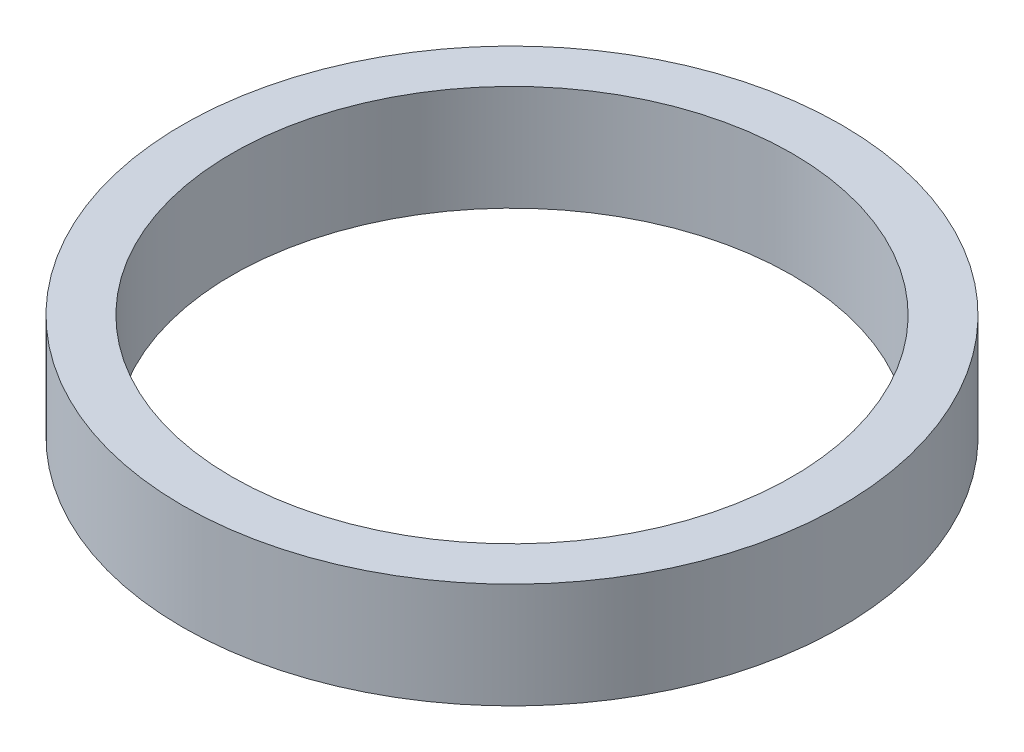
ISO-10303-21;
HEADER;
FILE_DESCRIPTION(('STEP AP214'),'2;1');
FILE_NAME('part.step','',(''),(''),'','','');
FILE_SCHEMA(('AUTOMOTIVE_DESIGN { 1 0 10303 214 1 1 1 1 }'));
ENDSEC;
DATA;
#1=APPLICATION_CONTEXT('core data for automotive mechanical design processes');
#2=APPLICATION_PROTOCOL_DEFINITION('international standard','automotive_design',2000,#1);
#3=PRODUCT_CONTEXT('',#1,'mechanical');
#4=PRODUCT('Part','Part','',(#3));
#5=PRODUCT_RELATED_PRODUCT_CATEGORY('part','',(#4));
#6=PRODUCT_DEFINITION_FORMATION('','',#4);
#7=PRODUCT_DEFINITION_CONTEXT('part definition',#1,'design');
#8=PRODUCT_DEFINITION('design','',#6,#7);
#9=PRODUCT_DEFINITION_SHAPE('','',#8);
#10=(LENGTH_UNIT() NAMED_UNIT(*) SI_UNIT(.MILLI.,.METRE.));
#11=(NAMED_UNIT(*) PLANE_ANGLE_UNIT() SI_UNIT($,.RADIAN.));
#12=(NAMED_UNIT(*) SI_UNIT($,.STERADIAN.) SOLID_ANGLE_UNIT());
#13=UNCERTAINTY_MEASURE_WITH_UNIT(LENGTH_MEASURE(1.E-05),#10,'distance_accuracy_value','');
#14=(GEOMETRIC_REPRESENTATION_CONTEXT(3) GLOBAL_UNCERTAINTY_ASSIGNED_CONTEXT((#13)) GLOBAL_UNIT_ASSIGNED_CONTEXT((#10,
#11,#12)) REPRESENTATION_CONTEXT('',''));
#15=CARTESIAN_POINT('',(0.,0.,0.));
#16=DIRECTION('',(0.,0.,1.));
#17=DIRECTION('',(1.,0.,0.));
#18=AXIS2_PLACEMENT_3D('',#15,#16,#17);
#19=CARTESIAN_POINT('',(0.,16.,0.));
#20=DIRECTION('',(0.,-1.,0.));
#21=DIRECTION('',(0.,0.,-1.));
#22=AXIS2_PLACEMENT_3D('',#19,#20,#21);
#23=CYLINDRICAL_SURFACE('',#22,50.);
#24=CARTESIAN_POINT('',(0.,16.,0.));
#25=DIRECTION('',(0.,1.,0.));
#26=DIRECTION('',(0.,0.,1.));
#27=AXIS2_PLACEMENT_3D('',#24,#25,#26);
#28=CIRCLE('',#27,50.);
#29=CARTESIAN_POINT('',(0.,16.,50.));
#30=VERTEX_POINT('',#29);
#31=EDGE_CURVE('E10',#30,#30,#28,.T.);
#32=ORIENTED_EDGE('',*,*,#31,.F.);
#33=EDGE_LOOP('',(#32));
#34=FACE_BOUND('',#33,.T.);
#35=CARTESIAN_POINT('',(0.,0.,0.));
#36=DIRECTION('',(0.,1.,0.));
#37=DIRECTION('',(0.,0.,1.));
#38=AXIS2_PLACEMENT_3D('',#35,#36,#37);
#39=CIRCLE('',#38,50.);
#40=CARTESIAN_POINT('',(0.,0.,50.));
#41=VERTEX_POINT('',#40);
#42=EDGE_CURVE('E37',#41,#41,#39,.T.);
#43=ORIENTED_EDGE('',*,*,#42,.T.);
#44=EDGE_LOOP('',(#43));
#45=FACE_BOUND('',#44,.T.);
#46=ADVANCED_FACE('F40',(#34,#45),#23,.T.);
#47=CARTESIAN_POINT('',(0.,16.,0.));
#48=DIRECTION('',(0.,1.,0.));
#49=DIRECTION('',(0.,0.,1.));
#50=AXIS2_PLACEMENT_3D('',#47,#48,#49);
#51=PLANE('',#50);
#52=CARTESIAN_POINT('',(0.,16.,0.));
#53=DIRECTION('',(0.,1.,0.));
#54=DIRECTION('',(0.,0.,1.));
#55=AXIS2_PLACEMENT_3D('',#52,#53,#54);
#56=CIRCLE('',#55,42.5);
#57=CARTESIAN_POINT('',(0.,16.,42.5));
#58=VERTEX_POINT('',#57);
#59=EDGE_CURVE('E50',#58,#58,#56,.T.);
#60=ORIENTED_EDGE('',*,*,#59,.F.);
#61=EDGE_LOOP('',(#60));
#62=FACE_BOUND('',#61,.T.);
#63=ORIENTED_EDGE('',*,*,#31,.T.);
#64=EDGE_LOOP('',(#63));
#65=FACE_BOUND('',#64,.T.);
#66=ADVANCED_FACE('F59',(#62,#65),#51,.T.);
#67=CARTESIAN_POINT('',(0.,0.,0.));
#68=DIRECTION('',(0.,1.,0.));
#69=DIRECTION('',(0.,0.,1.));
#70=AXIS2_PLACEMENT_3D('',#67,#68,#69);
#71=PLANE('',#70);
#72=CARTESIAN_POINT('',(0.,0.,0.));
#73=DIRECTION('',(0.,1.,0.));
#74=DIRECTION('',(0.,0.,1.));
#75=AXIS2_PLACEMENT_3D('',#72,#73,#74);
#76=CIRCLE('',#75,42.5);
#77=CARTESIAN_POINT('',(0.,0.,42.5));
#78=VERTEX_POINT('',#77);
#79=EDGE_CURVE('E47',#78,#78,#76,.T.);
#80=ORIENTED_EDGE('',*,*,#79,.T.);
#81=EDGE_LOOP('',(#80));
#82=FACE_BOUND('',#81,.T.);
#83=ORIENTED_EDGE('',*,*,#42,.F.);
#84=EDGE_LOOP('',(#83));
#85=FACE_BOUND('',#84,.T.);
#86=ADVANCED_FACE('F58',(#82,#85),#71,.F.);
#87=CARTESIAN_POINT('',(0.,16.,0.));
#88=DIRECTION('',(0.,-1.,0.));
#89=DIRECTION('',(0.,0.,-1.));
#90=AXIS2_PLACEMENT_3D('',#87,#88,#89);
#91=CYLINDRICAL_SURFACE('',#90,42.5);
#92=ORIENTED_EDGE('',*,*,#59,.T.);
#93=EDGE_LOOP('',(#92));
#94=FACE_BOUND('',#93,.T.);
#95=ORIENTED_EDGE('',*,*,#79,.F.);
#96=EDGE_LOOP('',(#95));
#97=FACE_BOUND('',#96,.T.);
#98=ADVANCED_FACE('F54',(#94,#97),#91,.F.);
#99=CLOSED_SHELL('',(#46,#66,#86,#98));
#100=MANIFOLD_SOLID_BREP('B2',#99);
#101=ADVANCED_BREP_SHAPE_REPRESENTATION('',(#18,#100),#14);
#102=SHAPE_DEFINITION_REPRESENTATION(#9,#101);
ENDSEC;
END-ISO-10303-21;
